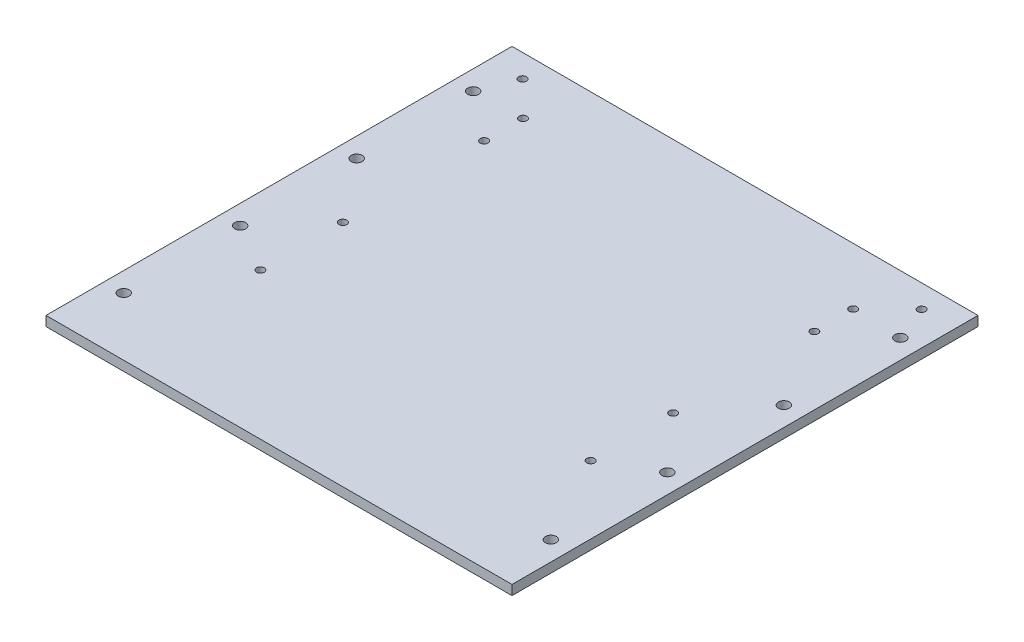
ISO-10303-21;
HEADER;
FILE_DESCRIPTION(('STEP AP214'),'2;1');
FILE_NAME('part.step','',(''),(''),'','','');
FILE_SCHEMA(('AUTOMOTIVE_DESIGN { 1 0 10303 214 1 1 1 1 }'));
ENDSEC;
DATA;
#1=APPLICATION_CONTEXT('core data for automotive mechanical design processes');
#2=APPLICATION_PROTOCOL_DEFINITION('international standard','automotive_design',2000,#1);
#3=PRODUCT_CONTEXT('',#1,'mechanical');
#4=PRODUCT('Part','Part','',(#3));
#5=PRODUCT_RELATED_PRODUCT_CATEGORY('part','',(#4));
#6=PRODUCT_DEFINITION_FORMATION('','',#4);
#7=PRODUCT_DEFINITION_CONTEXT('part definition',#1,'design');
#8=PRODUCT_DEFINITION('design','',#6,#7);
#9=PRODUCT_DEFINITION_SHAPE('','',#8);
#10=(LENGTH_UNIT() NAMED_UNIT(*) SI_UNIT(.MILLI.,.METRE.));
#11=(NAMED_UNIT(*) PLANE_ANGLE_UNIT() SI_UNIT($,.RADIAN.));
#12=(NAMED_UNIT(*) SI_UNIT($,.STERADIAN.) SOLID_ANGLE_UNIT());
#13=UNCERTAINTY_MEASURE_WITH_UNIT(LENGTH_MEASURE(1.E-05),#10,'distance_accuracy_value','');
#14=(GEOMETRIC_REPRESENTATION_CONTEXT(3) GLOBAL_UNCERTAINTY_ASSIGNED_CONTEXT((#13)) GLOBAL_UNIT_ASSIGNED_CONTEXT((#10,
#11,#12)) REPRESENTATION_CONTEXT('',''));
#15=CARTESIAN_POINT('',(0.,0.,0.));
#16=DIRECTION('',(0.,0.,1.));
#17=DIRECTION('',(1.,0.,0.));
#18=AXIS2_PLACEMENT_3D('',#15,#16,#17);
#19=CARTESIAN_POINT('',(152.4,6.35,-152.4));
#20=DIRECTION('',(-1.,0.,0.));
#21=DIRECTION('',(0.,0.,1.));
#22=AXIS2_PLACEMENT_3D('',#19,#20,#21);
#23=PLANE('',#22);
#24=DIRECTION('',(0.,0.,-1.));
#25=VECTOR('',#24,1.);
#26=CARTESIAN_POINT('',(152.4,0.,-152.4));
#27=LINE('',#26,#25);
#28=CARTESIAN_POINT('',(152.4,0.,152.4));
#29=VERTEX_POINT('',#28);
#30=CARTESIAN_POINT('',(152.4,0.,-152.4));
#31=VERTEX_POINT('',#30);
#32=EDGE_CURVE('E85',#29,#31,#27,.T.);
#33=ORIENTED_EDGE('',*,*,#32,.T.);
#34=DIRECTION('',(0.,-1.,0.));
#35=VECTOR('',#34,1.);
#36=CARTESIAN_POINT('',(152.4,6.35,-152.4));
#37=LINE('',#36,#35);
#38=CARTESIAN_POINT('',(152.4,6.35,-152.4));
#39=VERTEX_POINT('',#38);
#40=EDGE_CURVE('E173',#39,#31,#37,.T.);
#41=ORIENTED_EDGE('',*,*,#40,.F.);
#42=DIRECTION('',(0.,0.,-1.));
#43=VECTOR('',#42,1.);
#44=CARTESIAN_POINT('',(152.4,6.35,-152.4));
#45=LINE('',#44,#43);
#46=CARTESIAN_POINT('',(152.4,6.35,152.4));
#47=VERTEX_POINT('',#46);
#48=EDGE_CURVE('E87',#47,#39,#45,.T.);
#49=ORIENTED_EDGE('',*,*,#48,.F.);
#50=DIRECTION('',(0.,-1.,0.));
#51=VECTOR('',#50,1.);
#52=CARTESIAN_POINT('',(152.4,6.35,152.4));
#53=LINE('',#52,#51);
#54=EDGE_CURVE('E169',#47,#29,#53,.T.);
#55=ORIENTED_EDGE('',*,*,#54,.T.);
#56=EDGE_LOOP('',(#33,#41,#49,#55));
#57=FACE_BOUND('',#56,.T.);
#58=ADVANCED_FACE('F37',(#57),#23,.F.);
#59=CARTESIAN_POINT('',(0.,6.35,-152.4));
#60=DIRECTION('',(0.,0.,1.));
#61=DIRECTION('',(1.,0.,0.));
#62=AXIS2_PLACEMENT_3D('',#59,#60,#61);
#63=PLANE('',#62);
#64=DIRECTION('',(-1.,0.,0.));
#65=VECTOR('',#64,1.);
#66=CARTESIAN_POINT('',(0.,0.,-152.4));
#67=LINE('',#66,#65);
#68=CARTESIAN_POINT('',(-152.4,0.,-152.4));
#69=VERTEX_POINT('',#68);
#70=EDGE_CURVE('E66',#31,#69,#67,.T.);
#71=ORIENTED_EDGE('',*,*,#70,.T.);
#72=DIRECTION('',(0.,-1.,0.));
#73=VECTOR('',#72,1.);
#74=CARTESIAN_POINT('',(-152.4,6.35,-152.4));
#75=LINE('',#74,#73);
#76=CARTESIAN_POINT('',(-152.4,6.35,-152.4));
#77=VERTEX_POINT('',#76);
#78=EDGE_CURVE('E94',#77,#69,#75,.T.);
#79=ORIENTED_EDGE('',*,*,#78,.F.);
#80=DIRECTION('',(-1.,0.,0.));
#81=VECTOR('',#80,1.);
#82=CARTESIAN_POINT('',(0.,6.35,-152.4));
#83=LINE('',#82,#81);
#84=EDGE_CURVE('E166',#39,#77,#83,.T.);
#85=ORIENTED_EDGE('',*,*,#84,.F.);
#86=ORIENTED_EDGE('',*,*,#40,.T.);
#87=EDGE_LOOP('',(#71,#79,#85,#86));
#88=FACE_BOUND('',#87,.T.);
#89=ADVANCED_FACE('F241',(#88),#63,.F.);
#90=CARTESIAN_POINT('',(0.,6.35,152.4));
#91=DIRECTION('',(0.,0.,-1.));
#92=DIRECTION('',(-1.,0.,0.));
#93=AXIS2_PLACEMENT_3D('',#90,#91,#92);
#94=PLANE('',#93);
#95=DIRECTION('',(1.,0.,0.));
#96=VECTOR('',#95,1.);
#97=CARTESIAN_POINT('',(0.,0.,152.4));
#98=LINE('',#97,#96);
#99=CARTESIAN_POINT('',(-152.4,0.,152.4));
#100=VERTEX_POINT('',#99);
#101=EDGE_CURVE('E79',#100,#29,#98,.T.);
#102=ORIENTED_EDGE('',*,*,#101,.T.);
#103=ORIENTED_EDGE('',*,*,#54,.F.);
#104=DIRECTION('',(1.,0.,0.));
#105=VECTOR('',#104,1.);
#106=CARTESIAN_POINT('',(0.,6.35,152.4));
#107=LINE('',#106,#105);
#108=CARTESIAN_POINT('',(-152.4,6.35,152.4));
#109=VERTEX_POINT('',#108);
#110=EDGE_CURVE('E54',#109,#47,#107,.T.);
#111=ORIENTED_EDGE('',*,*,#110,.F.);
#112=DIRECTION('',(0.,-1.,0.));
#113=VECTOR('',#112,1.);
#114=CARTESIAN_POINT('',(-152.4,6.35,152.4));
#115=LINE('',#114,#113);
#116=EDGE_CURVE('E90',#109,#100,#115,.T.);
#117=ORIENTED_EDGE('',*,*,#116,.T.);
#118=EDGE_LOOP('',(#102,#103,#111,#117));
#119=FACE_BOUND('',#118,.T.);
#120=ADVANCED_FACE('F91',(#119),#94,.F.);
#121=CARTESIAN_POINT('',(0.,6.35,0.));
#122=DIRECTION('',(0.,1.,0.));
#123=DIRECTION('',(0.,0.,1.));
#124=AXIS2_PLACEMENT_3D('',#121,#122,#123);
#125=PLANE('',#124);
#126=CARTESIAN_POINT('',(139.7,6.35,-38.1));
#127=DIRECTION('',(0.,1.,0.));
#128=DIRECTION('',(0.,0.,1.));
#129=AXIS2_PLACEMENT_3D('',#126,#127,#128);
#130=CIRCLE('',#129,3.57124);
#131=CARTESIAN_POINT('',(139.7,6.35,-34.52876));
#132=VERTEX_POINT('',#131);
#133=EDGE_CURVE('E125',#132,#132,#130,.T.);
#134=ORIENTED_EDGE('',*,*,#133,.F.);
#135=EDGE_LOOP('',(#134));
#136=FACE_BOUND('',#135,.T.);
#137=CARTESIAN_POINT('',(139.7,6.35,-114.3));
#138=DIRECTION('',(0.,1.,0.));
#139=DIRECTION('',(0.,0.,1.));
#140=AXIS2_PLACEMENT_3D('',#137,#138,#139);
#141=CIRCLE('',#140,3.57124);
#142=CARTESIAN_POINT('',(139.7,6.35,-110.72876));
#143=VERTEX_POINT('',#142);
#144=EDGE_CURVE('E131',#143,#143,#141,.T.);
#145=ORIENTED_EDGE('',*,*,#144,.F.);
#146=EDGE_LOOP('',(#145));
#147=FACE_BOUND('',#146,.T.);
#148=CARTESIAN_POINT('',(130.5,6.35,-137.4));
#149=DIRECTION('',(0.,1.,0.));
#150=DIRECTION('',(0.,0.,1.));
#151=AXIS2_PLACEMENT_3D('',#148,#149,#150);
#152=CIRCLE('',#151,2.55269999999999);
#153=CARTESIAN_POINT('',(130.5,6.35,-134.8473));
#154=VERTEX_POINT('',#153);
#155=EDGE_CURVE('E135',#154,#154,#152,.T.);
#156=ORIENTED_EDGE('',*,*,#155,.F.);
#157=EDGE_LOOP('',(#156));
#158=FACE_BOUND('',#157,.T.);
#159=CARTESIAN_POINT('',(108.,6.35,-115.175));
#160=DIRECTION('',(0.,1.,0.));
#161=DIRECTION('',(0.,0.,1.));
#162=AXIS2_PLACEMENT_3D('',#159,#160,#161);
#163=CIRCLE('',#162,2.55270000000001);
#164=CARTESIAN_POINT('',(108.,6.35,-112.6223));
#165=VERTEX_POINT('',#164);
#166=EDGE_CURVE('E141',#165,#165,#163,.T.);
#167=ORIENTED_EDGE('',*,*,#166,.F.);
#168=EDGE_LOOP('',(#167));
#169=FACE_BOUND('',#168,.T.);
#170=CARTESIAN_POINT('',(108.,6.35,2.59999999999999));
#171=DIRECTION('',(0.,1.,0.));
#172=DIRECTION('',(0.,0.,1.));
#173=AXIS2_PLACEMENT_3D('',#170,#171,#172);
#174=CIRCLE('',#173,2.55270000000001);
#175=CARTESIAN_POINT('',(108.,6.35,5.1527));
#176=VERTEX_POINT('',#175);
#177=EDGE_CURVE('E147',#176,#176,#174,.T.);
#178=ORIENTED_EDGE('',*,*,#177,.F.);
#179=EDGE_LOOP('',(#178));
#180=FACE_BOUND('',#179,.T.);
#181=CARTESIAN_POINT('',(108.,6.35,56.575));
#182=DIRECTION('',(0.,1.,0.));
#183=DIRECTION('',(0.,0.,1.));
#184=AXIS2_PLACEMENT_3D('',#181,#182,#183);
#185=CIRCLE('',#184,2.55270000000001);
#186=CARTESIAN_POINT('',(108.,6.35,59.1277));
#187=VERTEX_POINT('',#186);
#188=EDGE_CURVE('E153',#187,#187,#185,.T.);
#189=ORIENTED_EDGE('',*,*,#188,.F.);
#190=EDGE_LOOP('',(#189));
#191=FACE_BOUND('',#190,.T.);
#192=CARTESIAN_POINT('',(108.,6.35,-89.775));
#193=DIRECTION('',(0.,1.,0.));
#194=DIRECTION('',(0.,0.,1.));
#195=AXIS2_PLACEMENT_3D('',#192,#193,#194);
#196=CIRCLE('',#195,2.55270000000001);
#197=CARTESIAN_POINT('',(108.,6.35,-87.2223));
#198=VERTEX_POINT('',#197);
#199=EDGE_CURVE('E159',#198,#198,#196,.T.);
#200=ORIENTED_EDGE('',*,*,#199,.F.);
#201=EDGE_LOOP('',(#200));
#202=FACE_BOUND('',#201,.T.);
#203=ORIENTED_EDGE('',*,*,#48,.T.);
#204=ORIENTED_EDGE('',*,*,#84,.T.);
#205=DIRECTION('',(0.,0.,-1.));
#206=VECTOR('',#205,1.);
#207=CARTESIAN_POINT('',(-152.4,6.35,-152.4));
#208=LINE('',#207,#206);
#209=EDGE_CURVE('E95',#109,#77,#208,.T.);
#210=ORIENTED_EDGE('',*,*,#209,.F.);
#211=ORIENTED_EDGE('',*,*,#110,.T.);
#212=EDGE_LOOP('',(#203,#204,#210,#211));
#213=FACE_BOUND('',#212,.T.);
#214=CARTESIAN_POINT('',(139.7,6.35,38.1));
#215=DIRECTION('',(0.,1.,0.));
#216=DIRECTION('',(0.,0.,1.));
#217=AXIS2_PLACEMENT_3D('',#214,#215,#216);
#218=CIRCLE('',#217,3.57124);
#219=CARTESIAN_POINT('',(139.7,6.35,41.67124));
#220=VERTEX_POINT('',#219);
#221=EDGE_CURVE('E175',#220,#220,#218,.T.);
#222=ORIENTED_EDGE('',*,*,#221,.F.);
#223=EDGE_LOOP('',(#222));
#224=FACE_BOUND('',#223,.T.);
#225=CARTESIAN_POINT('',(139.7,6.35,114.3));
#226=DIRECTION('',(0.,1.,0.));
#227=DIRECTION('',(0.,0.,1.));
#228=AXIS2_PLACEMENT_3D('',#225,#226,#227);
#229=CIRCLE('',#228,3.57124);
#230=CARTESIAN_POINT('',(139.7,6.35,117.87124));
#231=VERTEX_POINT('',#230);
#232=EDGE_CURVE('E46',#231,#231,#229,.T.);
#233=ORIENTED_EDGE('',*,*,#232,.F.);
#234=EDGE_LOOP('',(#233));
#235=FACE_BOUND('',#234,.T.);
#236=CARTESIAN_POINT('',(-139.7,6.35,-38.1));
#237=DIRECTION('',(0.,-1.,0.));
#238=DIRECTION('',(0.,0.,1.));
#239=AXIS2_PLACEMENT_3D('',#236,#237,#238);
#240=CIRCLE('',#239,3.57124);
#241=CARTESIAN_POINT('',(-139.7,6.35,-34.52876));
#242=VERTEX_POINT('',#241);
#243=EDGE_CURVE('E195',#242,#242,#240,.T.);
#244=ORIENTED_EDGE('',*,*,#243,.T.);
#245=EDGE_LOOP('',(#244));
#246=FACE_BOUND('',#245,.T.);
#247=CARTESIAN_POINT('',(-139.7,6.35,-114.3));
#248=DIRECTION('',(0.,-1.,0.));
#249=DIRECTION('',(0.,0.,1.));
#250=AXIS2_PLACEMENT_3D('',#247,#248,#249);
#251=CIRCLE('',#250,3.57124);
#252=CARTESIAN_POINT('',(-139.7,6.35,-110.72876));
#253=VERTEX_POINT('',#252);
#254=EDGE_CURVE('E113',#253,#253,#251,.T.);
#255=ORIENTED_EDGE('',*,*,#254,.T.);
#256=EDGE_LOOP('',(#255));
#257=FACE_BOUND('',#256,.T.);
#258=CARTESIAN_POINT('',(-130.5,6.35,-137.4));
#259=DIRECTION('',(0.,-1.,0.));
#260=DIRECTION('',(0.,0.,1.));
#261=AXIS2_PLACEMENT_3D('',#258,#259,#260);
#262=CIRCLE('',#261,2.55269999999999);
#263=CARTESIAN_POINT('',(-130.5,6.35,-134.8473));
#264=VERTEX_POINT('',#263);
#265=EDGE_CURVE('E112',#264,#264,#262,.T.);
#266=ORIENTED_EDGE('',*,*,#265,.T.);
#267=EDGE_LOOP('',(#266));
#268=FACE_BOUND('',#267,.T.);
#269=CARTESIAN_POINT('',(-108.,6.35,-115.175));
#270=DIRECTION('',(0.,-1.,0.));
#271=DIRECTION('',(0.,0.,1.));
#272=AXIS2_PLACEMENT_3D('',#269,#270,#271);
#273=CIRCLE('',#272,2.55270000000001);
#274=CARTESIAN_POINT('',(-108.,6.35,-112.6223));
#275=VERTEX_POINT('',#274);
#276=EDGE_CURVE('E205',#275,#275,#273,.T.);
#277=ORIENTED_EDGE('',*,*,#276,.T.);
#278=EDGE_LOOP('',(#277));
#279=FACE_BOUND('',#278,.T.);
#280=CARTESIAN_POINT('',(-108.,6.35,2.59999999999999));
#281=DIRECTION('',(0.,-1.,0.));
#282=DIRECTION('',(0.,0.,1.));
#283=AXIS2_PLACEMENT_3D('',#280,#281,#282);
#284=CIRCLE('',#283,2.55270000000001);
#285=CARTESIAN_POINT('',(-108.,6.35,5.1527));
#286=VERTEX_POINT('',#285);
#287=EDGE_CURVE('E209',#286,#286,#284,.T.);
#288=ORIENTED_EDGE('',*,*,#287,.T.);
#289=EDGE_LOOP('',(#288));
#290=FACE_BOUND('',#289,.T.);
#291=CARTESIAN_POINT('',(-108.,6.35,56.575));
#292=DIRECTION('',(0.,-1.,0.));
#293=DIRECTION('',(0.,0.,1.));
#294=AXIS2_PLACEMENT_3D('',#291,#292,#293);
#295=CIRCLE('',#294,2.55270000000001);
#296=CARTESIAN_POINT('',(-108.,6.35,59.1277));
#297=VERTEX_POINT('',#296);
#298=EDGE_CURVE('E213',#297,#297,#295,.T.);
#299=ORIENTED_EDGE('',*,*,#298,.T.);
#300=EDGE_LOOP('',(#299));
#301=FACE_BOUND('',#300,.T.);
#302=CARTESIAN_POINT('',(-108.,6.35,-89.775));
#303=DIRECTION('',(0.,-1.,0.));
#304=DIRECTION('',(0.,0.,1.));
#305=AXIS2_PLACEMENT_3D('',#302,#303,#304);
#306=CIRCLE('',#305,2.55270000000001);
#307=CARTESIAN_POINT('',(-108.,6.35,-87.2223));
#308=VERTEX_POINT('',#307);
#309=EDGE_CURVE('E104',#308,#308,#306,.T.);
#310=ORIENTED_EDGE('',*,*,#309,.T.);
#311=EDGE_LOOP('',(#310));
#312=FACE_BOUND('',#311,.T.);
#313=CARTESIAN_POINT('',(-139.7,6.35,38.1));
#314=DIRECTION('',(0.,-1.,0.));
#315=DIRECTION('',(0.,0.,1.));
#316=AXIS2_PLACEMENT_3D('',#313,#314,#315);
#317=CIRCLE('',#316,3.57124);
#318=CARTESIAN_POINT('',(-139.7,6.35,41.67124));
#319=VERTEX_POINT('',#318);
#320=EDGE_CURVE('E108',#319,#319,#317,.T.);
#321=ORIENTED_EDGE('',*,*,#320,.T.);
#322=EDGE_LOOP('',(#321));
#323=FACE_BOUND('',#322,.T.);
#324=CARTESIAN_POINT('',(-139.7,6.35,114.3));
#325=DIRECTION('',(0.,-1.,0.));
#326=DIRECTION('',(0.,0.,1.));
#327=AXIS2_PLACEMENT_3D('',#324,#325,#326);
#328=CIRCLE('',#327,3.57124);
#329=CARTESIAN_POINT('',(-139.7,6.35,117.87124));
#330=VERTEX_POINT('',#329);
#331=EDGE_CURVE('E119',#330,#330,#328,.T.);
#332=ORIENTED_EDGE('',*,*,#331,.T.);
#333=EDGE_LOOP('',(#332));
#334=FACE_BOUND('',#333,.T.);
#335=ADVANCED_FACE('F187',(#136,#147,#158,#169,#180,#191,#202,#213,#224,#235,#246,#257,#268,
#279,#290,#301,#312,#323,#334),#125,.T.);
#336=CARTESIAN_POINT('',(0.,0.,0.));
#337=DIRECTION('',(0.,1.,0.));
#338=DIRECTION('',(0.,0.,1.));
#339=AXIS2_PLACEMENT_3D('',#336,#337,#338);
#340=PLANE('',#339);
#341=CARTESIAN_POINT('',(139.7,0.,-38.1));
#342=DIRECTION('',(0.,1.,0.));
#343=DIRECTION('',(0.,0.,1.));
#344=AXIS2_PLACEMENT_3D('',#341,#342,#343);
#345=CIRCLE('',#344,3.57124);
#346=CARTESIAN_POINT('',(139.7,0.,-34.52876));
#347=VERTEX_POINT('',#346);
#348=EDGE_CURVE('E128',#347,#347,#345,.T.);
#349=ORIENTED_EDGE('',*,*,#348,.T.);
#350=EDGE_LOOP('',(#349));
#351=FACE_BOUND('',#350,.T.);
#352=CARTESIAN_POINT('',(139.7,0.,-114.3));
#353=DIRECTION('',(0.,1.,0.));
#354=DIRECTION('',(0.,0.,1.));
#355=AXIS2_PLACEMENT_3D('',#352,#353,#354);
#356=CIRCLE('',#355,3.57124);
#357=CARTESIAN_POINT('',(139.7,0.,-110.72876));
#358=VERTEX_POINT('',#357);
#359=EDGE_CURVE('E134',#358,#358,#356,.T.);
#360=ORIENTED_EDGE('',*,*,#359,.T.);
#361=EDGE_LOOP('',(#360));
#362=FACE_BOUND('',#361,.T.);
#363=CARTESIAN_POINT('',(130.5,0.,-137.4));
#364=DIRECTION('',(0.,1.,0.));
#365=DIRECTION('',(0.,0.,1.));
#366=AXIS2_PLACEMENT_3D('',#363,#364,#365);
#367=CIRCLE('',#366,2.55269999999999);
#368=CARTESIAN_POINT('',(130.5,0.,-134.8473));
#369=VERTEX_POINT('',#368);
#370=EDGE_CURVE('E138',#369,#369,#367,.T.);
#371=ORIENTED_EDGE('',*,*,#370,.T.);
#372=EDGE_LOOP('',(#371));
#373=FACE_BOUND('',#372,.T.);
#374=CARTESIAN_POINT('',(108.,0.,-115.175));
#375=DIRECTION('',(0.,1.,0.));
#376=DIRECTION('',(0.,0.,1.));
#377=AXIS2_PLACEMENT_3D('',#374,#375,#376);
#378=CIRCLE('',#377,2.55270000000001);
#379=CARTESIAN_POINT('',(108.,0.,-112.6223));
#380=VERTEX_POINT('',#379);
#381=EDGE_CURVE('E144',#380,#380,#378,.T.);
#382=ORIENTED_EDGE('',*,*,#381,.T.);
#383=EDGE_LOOP('',(#382));
#384=FACE_BOUND('',#383,.T.);
#385=CARTESIAN_POINT('',(108.,0.,2.59999999999999));
#386=DIRECTION('',(0.,1.,0.));
#387=DIRECTION('',(0.,0.,1.));
#388=AXIS2_PLACEMENT_3D('',#385,#386,#387);
#389=CIRCLE('',#388,2.55270000000001);
#390=CARTESIAN_POINT('',(108.,0.,5.1527));
#391=VERTEX_POINT('',#390);
#392=EDGE_CURVE('E150',#391,#391,#389,.T.);
#393=ORIENTED_EDGE('',*,*,#392,.T.);
#394=EDGE_LOOP('',(#393));
#395=FACE_BOUND('',#394,.T.);
#396=CARTESIAN_POINT('',(108.,0.,56.575));
#397=DIRECTION('',(0.,1.,0.));
#398=DIRECTION('',(0.,0.,1.));
#399=AXIS2_PLACEMENT_3D('',#396,#397,#398);
#400=CIRCLE('',#399,2.55270000000001);
#401=CARTESIAN_POINT('',(108.,0.,59.1277));
#402=VERTEX_POINT('',#401);
#403=EDGE_CURVE('E156',#402,#402,#400,.T.);
#404=ORIENTED_EDGE('',*,*,#403,.T.);
#405=EDGE_LOOP('',(#404));
#406=FACE_BOUND('',#405,.T.);
#407=CARTESIAN_POINT('',(108.,0.,-89.775));
#408=DIRECTION('',(0.,1.,0.));
#409=DIRECTION('',(0.,0.,1.));
#410=AXIS2_PLACEMENT_3D('',#407,#408,#409);
#411=CIRCLE('',#410,2.55270000000001);
#412=CARTESIAN_POINT('',(108.,0.,-87.2223));
#413=VERTEX_POINT('',#412);
#414=EDGE_CURVE('E162',#413,#413,#411,.T.);
#415=ORIENTED_EDGE('',*,*,#414,.T.);
#416=EDGE_LOOP('',(#415));
#417=FACE_BOUND('',#416,.T.);
#418=ORIENTED_EDGE('',*,*,#32,.F.);
#419=ORIENTED_EDGE('',*,*,#101,.F.);
#420=DIRECTION('',(0.,0.,-1.));
#421=VECTOR('',#420,1.);
#422=CARTESIAN_POINT('',(-152.4,0.,-152.4));
#423=LINE('',#422,#421);
#424=EDGE_CURVE('E83',#100,#69,#423,.T.);
#425=ORIENTED_EDGE('',*,*,#424,.T.);
#426=ORIENTED_EDGE('',*,*,#70,.F.);
#427=EDGE_LOOP('',(#418,#419,#425,#426));
#428=FACE_BOUND('',#427,.T.);
#429=CARTESIAN_POINT('',(139.7,0.,38.1));
#430=DIRECTION('',(0.,1.,0.));
#431=DIRECTION('',(0.,0.,1.));
#432=AXIS2_PLACEMENT_3D('',#429,#430,#431);
#433=CIRCLE('',#432,3.57124);
#434=CARTESIAN_POINT('',(139.7,0.,41.67124));
#435=VERTEX_POINT('',#434);
#436=EDGE_CURVE('E180',#435,#435,#433,.T.);
#437=ORIENTED_EDGE('',*,*,#436,.T.);
#438=EDGE_LOOP('',(#437));
#439=FACE_BOUND('',#438,.T.);
#440=CARTESIAN_POINT('',(139.7,0.,114.3));
#441=DIRECTION('',(0.,1.,0.));
#442=DIRECTION('',(0.,0.,1.));
#443=AXIS2_PLACEMENT_3D('',#440,#441,#442);
#444=CIRCLE('',#443,3.57124);
#445=CARTESIAN_POINT('',(139.7,0.,117.87124));
#446=VERTEX_POINT('',#445);
#447=EDGE_CURVE('E11',#446,#446,#444,.T.);
#448=ORIENTED_EDGE('',*,*,#447,.T.);
#449=EDGE_LOOP('',(#448));
#450=FACE_BOUND('',#449,.T.);
#451=CARTESIAN_POINT('',(-139.7,0.,-38.1));
#452=DIRECTION('',(0.,-1.,0.));
#453=DIRECTION('',(0.,0.,1.));
#454=AXIS2_PLACEMENT_3D('',#451,#452,#453);
#455=CIRCLE('',#454,3.57124);
#456=CARTESIAN_POINT('',(-139.7,0.,-34.52876));
#457=VERTEX_POINT('',#456);
#458=EDGE_CURVE('E269',#457,#457,#455,.T.);
#459=ORIENTED_EDGE('',*,*,#458,.F.);
#460=EDGE_LOOP('',(#459));
#461=FACE_BOUND('',#460,.T.);
#462=CARTESIAN_POINT('',(-139.7,0.,-114.3));
#463=DIRECTION('',(0.,-1.,0.));
#464=DIRECTION('',(0.,0.,1.));
#465=AXIS2_PLACEMENT_3D('',#462,#463,#464);
#466=CIRCLE('',#465,3.57124);
#467=CARTESIAN_POINT('',(-139.7,0.,-110.72876));
#468=VERTEX_POINT('',#467);
#469=EDGE_CURVE('E109',#468,#468,#466,.T.);
#470=ORIENTED_EDGE('',*,*,#469,.F.);
#471=EDGE_LOOP('',(#470));
#472=FACE_BOUND('',#471,.T.);
#473=CARTESIAN_POINT('',(-130.5,0.,-137.4));
#474=DIRECTION('',(0.,-1.,0.));
#475=DIRECTION('',(0.,0.,1.));
#476=AXIS2_PLACEMENT_3D('',#473,#474,#475);
#477=CIRCLE('',#476,2.55269999999999);
#478=CARTESIAN_POINT('',(-130.5,0.,-134.8473));
#479=VERTEX_POINT('',#478);
#480=EDGE_CURVE('E275',#479,#479,#477,.T.);
#481=ORIENTED_EDGE('',*,*,#480,.F.);
#482=EDGE_LOOP('',(#481));
#483=FACE_BOUND('',#482,.T.);
#484=CARTESIAN_POINT('',(-108.,0.,-115.175));
#485=DIRECTION('',(0.,-1.,0.));
#486=DIRECTION('',(0.,0.,1.));
#487=AXIS2_PLACEMENT_3D('',#484,#485,#486);
#488=CIRCLE('',#487,2.55270000000001);
#489=CARTESIAN_POINT('',(-108.,0.,-112.6223));
#490=VERTEX_POINT('',#489);
#491=EDGE_CURVE('E279',#490,#490,#488,.T.);
#492=ORIENTED_EDGE('',*,*,#491,.F.);
#493=EDGE_LOOP('',(#492));
#494=FACE_BOUND('',#493,.T.);
#495=CARTESIAN_POINT('',(-108.,0.,2.59999999999999));
#496=DIRECTION('',(0.,-1.,0.));
#497=DIRECTION('',(0.,0.,1.));
#498=AXIS2_PLACEMENT_3D('',#495,#496,#497);
#499=CIRCLE('',#498,2.55270000000001);
#500=CARTESIAN_POINT('',(-108.,0.,5.1527));
#501=VERTEX_POINT('',#500);
#502=EDGE_CURVE('E283',#501,#501,#499,.T.);
#503=ORIENTED_EDGE('',*,*,#502,.F.);
#504=EDGE_LOOP('',(#503));
#505=FACE_BOUND('',#504,.T.);
#506=CARTESIAN_POINT('',(-108.,0.,56.575));
#507=DIRECTION('',(0.,-1.,0.));
#508=DIRECTION('',(0.,0.,1.));
#509=AXIS2_PLACEMENT_3D('',#506,#507,#508);
#510=CIRCLE('',#509,2.55270000000001);
#511=CARTESIAN_POINT('',(-108.,0.,59.1277));
#512=VERTEX_POINT('',#511);
#513=EDGE_CURVE('E287',#512,#512,#510,.T.);
#514=ORIENTED_EDGE('',*,*,#513,.F.);
#515=EDGE_LOOP('',(#514));
#516=FACE_BOUND('',#515,.T.);
#517=CARTESIAN_POINT('',(-108.,0.,-89.775));
#518=DIRECTION('',(0.,-1.,0.));
#519=DIRECTION('',(0.,0.,1.));
#520=AXIS2_PLACEMENT_3D('',#517,#518,#519);
#521=CIRCLE('',#520,2.55270000000001);
#522=CARTESIAN_POINT('',(-108.,0.,-87.2223));
#523=VERTEX_POINT('',#522);
#524=EDGE_CURVE('E100',#523,#523,#521,.T.);
#525=ORIENTED_EDGE('',*,*,#524,.F.);
#526=EDGE_LOOP('',(#525));
#527=FACE_BOUND('',#526,.T.);
#528=CARTESIAN_POINT('',(-139.7,0.,38.1));
#529=DIRECTION('',(0.,-1.,0.));
#530=DIRECTION('',(0.,0.,1.));
#531=AXIS2_PLACEMENT_3D('',#528,#529,#530);
#532=CIRCLE('',#531,3.57124);
#533=CARTESIAN_POINT('',(-139.7,0.,41.67124));
#534=VERTEX_POINT('',#533);
#535=EDGE_CURVE('E116',#534,#534,#532,.T.);
#536=ORIENTED_EDGE('',*,*,#535,.F.);
#537=EDGE_LOOP('',(#536));
#538=FACE_BOUND('',#537,.T.);
#539=CARTESIAN_POINT('',(-139.7,0.,114.3));
#540=DIRECTION('',(0.,-1.,0.));
#541=DIRECTION('',(0.,0.,1.));
#542=AXIS2_PLACEMENT_3D('',#539,#540,#541);
#543=CIRCLE('',#542,3.57124);
#544=CARTESIAN_POINT('',(-139.7,0.,117.87124));
#545=VERTEX_POINT('',#544);
#546=EDGE_CURVE('E122',#545,#545,#543,.T.);
#547=ORIENTED_EDGE('',*,*,#546,.F.);
#548=EDGE_LOOP('',(#547));
#549=FACE_BOUND('',#548,.T.);
#550=ADVANCED_FACE('F80',(#351,#362,#373,#384,#395,#406,#417,#428,#439,#450,#461,#472,#483,#494,
#505,#516,#527,#538,#549),#340,.F.);
#551=CARTESIAN_POINT('',(108.,6.35,-89.775));
#552=DIRECTION('',(0.,1.,0.));
#553=DIRECTION('',(0.,0.,1.));
#554=AXIS2_PLACEMENT_3D('',#551,#552,#553);
#555=CYLINDRICAL_SURFACE('',#554,2.55270000000001);
#556=ORIENTED_EDGE('',*,*,#414,.F.);
#557=EDGE_LOOP('',(#556));
#558=FACE_BOUND('',#557,.T.);
#559=ORIENTED_EDGE('',*,*,#199,.T.);
#560=EDGE_LOOP('',(#559));
#561=FACE_BOUND('',#560,.T.);
#562=ADVANCED_FACE('F229',(#558,#561),#555,.F.);
#563=CARTESIAN_POINT('',(108.,6.35,56.575));
#564=DIRECTION('',(0.,1.,0.));
#565=DIRECTION('',(0.,0.,1.));
#566=AXIS2_PLACEMENT_3D('',#563,#564,#565);
#567=CYLINDRICAL_SURFACE('',#566,2.55270000000001);
#568=ORIENTED_EDGE('',*,*,#403,.F.);
#569=EDGE_LOOP('',(#568));
#570=FACE_BOUND('',#569,.T.);
#571=ORIENTED_EDGE('',*,*,#188,.T.);
#572=EDGE_LOOP('',(#571));
#573=FACE_BOUND('',#572,.T.);
#574=ADVANCED_FACE('F235',(#570,#573),#567,.F.);
#575=CARTESIAN_POINT('',(108.,6.35,2.59999999999999));
#576=DIRECTION('',(0.,1.,0.));
#577=DIRECTION('',(0.,0.,1.));
#578=AXIS2_PLACEMENT_3D('',#575,#576,#577);
#579=CYLINDRICAL_SURFACE('',#578,2.55270000000001);
#580=ORIENTED_EDGE('',*,*,#392,.F.);
#581=EDGE_LOOP('',(#580));
#582=FACE_BOUND('',#581,.T.);
#583=ORIENTED_EDGE('',*,*,#177,.T.);
#584=EDGE_LOOP('',(#583));
#585=FACE_BOUND('',#584,.T.);
#586=ADVANCED_FACE('F315',(#582,#585),#579,.F.);
#587=CARTESIAN_POINT('',(108.,6.35,-115.175));
#588=DIRECTION('',(0.,1.,0.));
#589=DIRECTION('',(0.,0.,1.));
#590=AXIS2_PLACEMENT_3D('',#587,#588,#589);
#591=CYLINDRICAL_SURFACE('',#590,2.55270000000001);
#592=ORIENTED_EDGE('',*,*,#381,.F.);
#593=EDGE_LOOP('',(#592));
#594=FACE_BOUND('',#593,.T.);
#595=ORIENTED_EDGE('',*,*,#166,.T.);
#596=EDGE_LOOP('',(#595));
#597=FACE_BOUND('',#596,.T.);
#598=ADVANCED_FACE('F311',(#594,#597),#591,.F.);
#599=CARTESIAN_POINT('',(130.5,6.35,-137.4));
#600=DIRECTION('',(0.,1.,0.));
#601=DIRECTION('',(0.,0.,1.));
#602=AXIS2_PLACEMENT_3D('',#599,#600,#601);
#603=CYLINDRICAL_SURFACE('',#602,2.55269999999999);
#604=ORIENTED_EDGE('',*,*,#370,.F.);
#605=EDGE_LOOP('',(#604));
#606=FACE_BOUND('',#605,.T.);
#607=ORIENTED_EDGE('',*,*,#155,.T.);
#608=EDGE_LOOP('',(#607));
#609=FACE_BOUND('',#608,.T.);
#610=ADVANCED_FACE('F307',(#606,#609),#603,.F.);
#611=CARTESIAN_POINT('',(139.7,6.35,-114.3));
#612=DIRECTION('',(0.,1.,0.));
#613=DIRECTION('',(0.,0.,1.));
#614=AXIS2_PLACEMENT_3D('',#611,#612,#613);
#615=CYLINDRICAL_SURFACE('',#614,3.57124);
#616=ORIENTED_EDGE('',*,*,#144,.T.);
#617=EDGE_LOOP('',(#616));
#618=FACE_BOUND('',#617,.T.);
#619=ORIENTED_EDGE('',*,*,#359,.F.);
#620=EDGE_LOOP('',(#619));
#621=FACE_BOUND('',#620,.T.);
#622=ADVANCED_FACE('F257',(#618,#621),#615,.F.);
#623=CARTESIAN_POINT('',(139.7,6.35,-38.1));
#624=DIRECTION('',(0.,1.,0.));
#625=DIRECTION('',(0.,0.,1.));
#626=AXIS2_PLACEMENT_3D('',#623,#624,#625);
#627=CYLINDRICAL_SURFACE('',#626,3.57124);
#628=ORIENTED_EDGE('',*,*,#133,.T.);
#629=EDGE_LOOP('',(#628));
#630=FACE_BOUND('',#629,.T.);
#631=ORIENTED_EDGE('',*,*,#348,.F.);
#632=EDGE_LOOP('',(#631));
#633=FACE_BOUND('',#632,.T.);
#634=ADVANCED_FACE('F251',(#630,#633),#627,.F.);
#635=CARTESIAN_POINT('',(139.7,6.35,38.1));
#636=DIRECTION('',(0.,1.,0.));
#637=DIRECTION('',(0.,0.,1.));
#638=AXIS2_PLACEMENT_3D('',#635,#636,#637);
#639=CYLINDRICAL_SURFACE('',#638,3.57124);
#640=ORIENTED_EDGE('',*,*,#221,.T.);
#641=EDGE_LOOP('',(#640));
#642=FACE_BOUND('',#641,.T.);
#643=ORIENTED_EDGE('',*,*,#436,.F.);
#644=EDGE_LOOP('',(#643));
#645=FACE_BOUND('',#644,.T.);
#646=ADVANCED_FACE('F249',(#642,#645),#639,.F.);
#647=CARTESIAN_POINT('',(139.7,6.35,114.3));
#648=DIRECTION('',(0.,1.,0.));
#649=DIRECTION('',(0.,0.,1.));
#650=AXIS2_PLACEMENT_3D('',#647,#648,#649);
#651=CYLINDRICAL_SURFACE('',#650,3.57124);
#652=ORIENTED_EDGE('',*,*,#232,.T.);
#653=EDGE_LOOP('',(#652));
#654=FACE_BOUND('',#653,.T.);
#655=ORIENTED_EDGE('',*,*,#447,.F.);
#656=EDGE_LOOP('',(#655));
#657=FACE_BOUND('',#656,.T.);
#658=ADVANCED_FACE('F39',(#654,#657),#651,.F.);
#659=CARTESIAN_POINT('',(-152.4,6.35,-152.4));
#660=DIRECTION('',(1.,0.,0.));
#661=DIRECTION('',(0.,0.,1.));
#662=AXIS2_PLACEMENT_3D('',#659,#660,#661);
#663=PLANE('',#662);
#664=ORIENTED_EDGE('',*,*,#424,.F.);
#665=ORIENTED_EDGE('',*,*,#116,.F.);
#666=ORIENTED_EDGE('',*,*,#209,.T.);
#667=ORIENTED_EDGE('',*,*,#78,.T.);
#668=EDGE_LOOP('',(#664,#665,#666,#667));
#669=FACE_BOUND('',#668,.T.);
#670=ADVANCED_FACE('F98',(#669),#663,.F.);
#671=CARTESIAN_POINT('',(-108.,6.35,-89.775));
#672=DIRECTION('',(0.,1.,0.));
#673=DIRECTION('',(0.,0.,1.));
#674=AXIS2_PLACEMENT_3D('',#671,#672,#673);
#675=CYLINDRICAL_SURFACE('',#674,2.55270000000001);
#676=ORIENTED_EDGE('',*,*,#524,.T.);
#677=EDGE_LOOP('',(#676));
#678=FACE_BOUND('',#677,.T.);
#679=ORIENTED_EDGE('',*,*,#309,.F.);
#680=EDGE_LOOP('',(#679));
#681=FACE_BOUND('',#680,.T.);
#682=ADVANCED_FACE('F416',(#678,#681),#675,.F.);
#683=CARTESIAN_POINT('',(-108.,6.35,56.575));
#684=DIRECTION('',(0.,1.,0.));
#685=DIRECTION('',(0.,0.,1.));
#686=AXIS2_PLACEMENT_3D('',#683,#684,#685);
#687=CYLINDRICAL_SURFACE('',#686,2.55270000000001);
#688=ORIENTED_EDGE('',*,*,#513,.T.);
#689=EDGE_LOOP('',(#688));
#690=FACE_BOUND('',#689,.T.);
#691=ORIENTED_EDGE('',*,*,#298,.F.);
#692=EDGE_LOOP('',(#691));
#693=FACE_BOUND('',#692,.T.);
#694=ADVANCED_FACE('F425',(#690,#693),#687,.F.);
#695=CARTESIAN_POINT('',(-108.,6.35,2.59999999999999));
#696=DIRECTION('',(0.,1.,0.));
#697=DIRECTION('',(0.,0.,1.));
#698=AXIS2_PLACEMENT_3D('',#695,#696,#697);
#699=CYLINDRICAL_SURFACE('',#698,2.55270000000001);
#700=ORIENTED_EDGE('',*,*,#502,.T.);
#701=EDGE_LOOP('',(#700));
#702=FACE_BOUND('',#701,.T.);
#703=ORIENTED_EDGE('',*,*,#287,.F.);
#704=EDGE_LOOP('',(#703));
#705=FACE_BOUND('',#704,.T.);
#706=ADVANCED_FACE('F435',(#702,#705),#699,.F.);
#707=CARTESIAN_POINT('',(-108.,6.35,-115.175));
#708=DIRECTION('',(0.,1.,0.));
#709=DIRECTION('',(0.,0.,1.));
#710=AXIS2_PLACEMENT_3D('',#707,#708,#709);
#711=CYLINDRICAL_SURFACE('',#710,2.55270000000001);
#712=ORIENTED_EDGE('',*,*,#491,.T.);
#713=EDGE_LOOP('',(#712));
#714=FACE_BOUND('',#713,.T.);
#715=ORIENTED_EDGE('',*,*,#276,.F.);
#716=EDGE_LOOP('',(#715));
#717=FACE_BOUND('',#716,.T.);
#718=ADVANCED_FACE('F446',(#714,#717),#711,.F.);
#719=CARTESIAN_POINT('',(-130.5,6.35,-137.4));
#720=DIRECTION('',(0.,1.,0.));
#721=DIRECTION('',(0.,0.,1.));
#722=AXIS2_PLACEMENT_3D('',#719,#720,#721);
#723=CYLINDRICAL_SURFACE('',#722,2.55269999999999);
#724=ORIENTED_EDGE('',*,*,#480,.T.);
#725=EDGE_LOOP('',(#724));
#726=FACE_BOUND('',#725,.T.);
#727=ORIENTED_EDGE('',*,*,#265,.F.);
#728=EDGE_LOOP('',(#727));
#729=FACE_BOUND('',#728,.T.);
#730=ADVANCED_FACE('F458',(#726,#729),#723,.F.);
#731=CARTESIAN_POINT('',(-139.7,6.35,-114.3));
#732=DIRECTION('',(0.,1.,0.));
#733=DIRECTION('',(0.,0.,1.));
#734=AXIS2_PLACEMENT_3D('',#731,#732,#733);
#735=CYLINDRICAL_SURFACE('',#734,3.57124);
#736=ORIENTED_EDGE('',*,*,#254,.F.);
#737=EDGE_LOOP('',(#736));
#738=FACE_BOUND('',#737,.T.);
#739=ORIENTED_EDGE('',*,*,#469,.T.);
#740=EDGE_LOOP('',(#739));
#741=FACE_BOUND('',#740,.T.);
#742=ADVANCED_FACE('F299',(#738,#741),#735,.F.);
#743=CARTESIAN_POINT('',(-139.7,6.35,-38.1));
#744=DIRECTION('',(0.,1.,0.));
#745=DIRECTION('',(0.,0.,1.));
#746=AXIS2_PLACEMENT_3D('',#743,#744,#745);
#747=CYLINDRICAL_SURFACE('',#746,3.57124);
#748=ORIENTED_EDGE('',*,*,#243,.F.);
#749=EDGE_LOOP('',(#748));
#750=FACE_BOUND('',#749,.T.);
#751=ORIENTED_EDGE('',*,*,#458,.T.);
#752=EDGE_LOOP('',(#751));
#753=FACE_BOUND('',#752,.T.);
#754=ADVANCED_FACE('F293',(#750,#753),#747,.F.);
#755=CARTESIAN_POINT('',(-139.7,6.35,38.1));
#756=DIRECTION('',(0.,1.,0.));
#757=DIRECTION('',(0.,0.,1.));
#758=AXIS2_PLACEMENT_3D('',#755,#756,#757);
#759=CYLINDRICAL_SURFACE('',#758,3.57124);
#760=ORIENTED_EDGE('',*,*,#320,.F.);
#761=EDGE_LOOP('',(#760));
#762=FACE_BOUND('',#761,.T.);
#763=ORIENTED_EDGE('',*,*,#535,.T.);
#764=EDGE_LOOP('',(#763));
#765=FACE_BOUND('',#764,.T.);
#766=ADVANCED_FACE('F224',(#762,#765),#759,.F.);
#767=CARTESIAN_POINT('',(-139.7,6.35,114.3));
#768=DIRECTION('',(0.,1.,0.));
#769=DIRECTION('',(0.,0.,1.));
#770=AXIS2_PLACEMENT_3D('',#767,#768,#769);
#771=CYLINDRICAL_SURFACE('',#770,3.57124);
#772=ORIENTED_EDGE('',*,*,#331,.F.);
#773=EDGE_LOOP('',(#772));
#774=FACE_BOUND('',#773,.T.);
#775=ORIENTED_EDGE('',*,*,#546,.T.);
#776=EDGE_LOOP('',(#775));
#777=FACE_BOUND('',#776,.T.);
#778=ADVANCED_FACE('F221',(#774,#777),#771,.F.);
#779=CLOSED_SHELL('',(#58,#89,#120,#335,#550,#562,#574,#586,#598,#610,#622,#634,#646,#658,#670,
#682,#694,#706,#718,#730,#742,#754,#766,#778));
#780=MANIFOLD_SOLID_BREP('B2',#779);
#781=ADVANCED_BREP_SHAPE_REPRESENTATION('',(#18,#780),#14);
#782=SHAPE_DEFINITION_REPRESENTATION(#9,#781);
ENDSEC;
END-ISO-10303-21;
